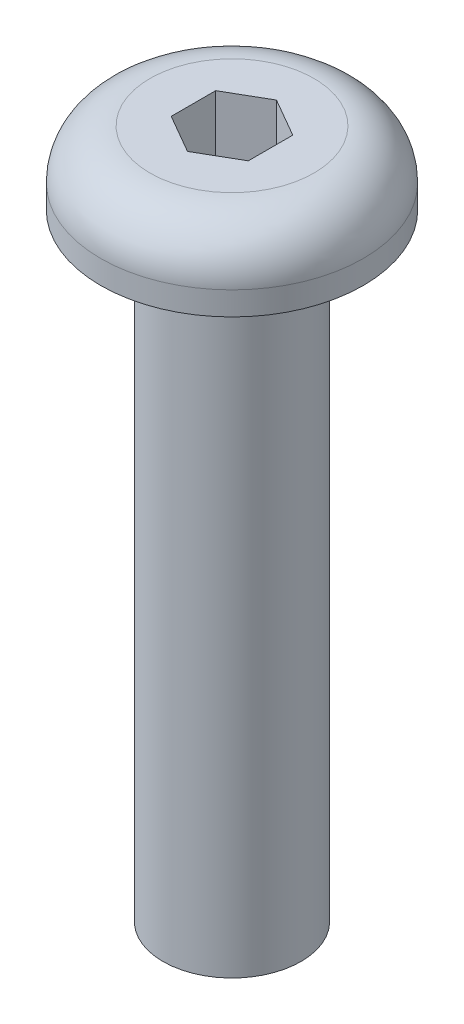
ISO-10303-21;
HEADER;
FILE_DESCRIPTION(('STEP AP214'),'2;1');
FILE_NAME('part.step','',(''),(''),'','','');
FILE_SCHEMA(('AUTOMOTIVE_DESIGN { 1 0 10303 214 1 1 1 1 }'));
ENDSEC;
DATA;
#1=APPLICATION_CONTEXT('core data for automotive mechanical design processes');
#2=APPLICATION_PROTOCOL_DEFINITION('international standard','automotive_design',2000,#1);
#3=PRODUCT_CONTEXT('',#1,'mechanical');
#4=PRODUCT('Part','Part','',(#3));
#5=PRODUCT_RELATED_PRODUCT_CATEGORY('part','',(#4));
#6=PRODUCT_DEFINITION_FORMATION('','',#4);
#7=PRODUCT_DEFINITION_CONTEXT('part definition',#1,'design');
#8=PRODUCT_DEFINITION('design','',#6,#7);
#9=PRODUCT_DEFINITION_SHAPE('','',#8);
#10=(LENGTH_UNIT() NAMED_UNIT(*) SI_UNIT(.MILLI.,.METRE.));
#11=(NAMED_UNIT(*) PLANE_ANGLE_UNIT() SI_UNIT($,.RADIAN.));
#12=(NAMED_UNIT(*) SI_UNIT($,.STERADIAN.) SOLID_ANGLE_UNIT());
#13=UNCERTAINTY_MEASURE_WITH_UNIT(LENGTH_MEASURE(1.E-05),#10,'distance_accuracy_value','');
#14=(GEOMETRIC_REPRESENTATION_CONTEXT(3) GLOBAL_UNCERTAINTY_ASSIGNED_CONTEXT((#13)) GLOBAL_UNIT_ASSIGNED_CONTEXT((#10,
#11,#12)) REPRESENTATION_CONTEXT('',''));
#15=CARTESIAN_POINT('',(0.,0.,0.));
#16=DIRECTION('',(0.,0.,1.));
#17=DIRECTION('',(1.,0.,0.));
#18=AXIS2_PLACEMENT_3D('',#15,#16,#17);
#19=CARTESIAN_POINT('',(0.,12.7,0.));
#20=DIRECTION('',(0.,-1.,0.));
#21=DIRECTION('',(0.,0.,-1.));
#22=AXIS2_PLACEMENT_3D('',#19,#20,#21);
#23=CYLINDRICAL_SURFACE('',#22,1.4224);
#24=CARTESIAN_POINT('',(0.,12.7,0.));
#25=DIRECTION('',(0.,1.,0.));
#26=DIRECTION('',(0.,0.,1.));
#27=AXIS2_PLACEMENT_3D('',#24,#25,#26);
#28=CIRCLE('',#27,1.4224);
#29=CARTESIAN_POINT('',(0.,12.7,1.4224));
#30=VERTEX_POINT('',#29);
#31=EDGE_CURVE('E143',#30,#30,#28,.T.);
#32=ORIENTED_EDGE('',*,*,#31,.F.);
#33=EDGE_LOOP('',(#32));
#34=FACE_BOUND('',#33,.T.);
#35=CARTESIAN_POINT('',(0.,0.,0.));
#36=DIRECTION('',(0.,1.,0.));
#37=DIRECTION('',(0.,0.,1.));
#38=AXIS2_PLACEMENT_3D('',#35,#36,#37);
#39=CIRCLE('',#38,1.4224);
#40=CARTESIAN_POINT('',(0.,0.,1.4224));
#41=VERTEX_POINT('',#40);
#42=EDGE_CURVE('E142',#41,#41,#39,.T.);
#43=ORIENTED_EDGE('',*,*,#42,.T.);
#44=EDGE_LOOP('',(#43));
#45=FACE_BOUND('',#44,.T.);
#46=ADVANCED_FACE('F32',(#34,#45),#23,.T.);
#47=CARTESIAN_POINT('',(0.,0.,0.));
#48=DIRECTION('',(0.,1.,0.));
#49=DIRECTION('',(0.,0.,1.));
#50=AXIS2_PLACEMENT_3D('',#47,#48,#49);
#51=PLANE('',#50);
#52=ORIENTED_EDGE('',*,*,#42,.F.);
#53=EDGE_LOOP('',(#52));
#54=FACE_BOUND('',#53,.T.);
#55=ADVANCED_FACE('F166',(#54),#51,.F.);
#56=CARTESIAN_POINT('',(0.,12.7,0.));
#57=DIRECTION('',(0.,1.,0.));
#58=DIRECTION('',(0.,0.,1.));
#59=AXIS2_PLACEMENT_3D('',#56,#57,#58);
#60=PLANE('',#59);
#61=CARTESIAN_POINT('',(0.,12.7,0.));
#62=DIRECTION('',(0.,1.,0.));
#63=DIRECTION('',(0.,0.,1.));
#64=AXIS2_PLACEMENT_3D('',#61,#62,#63);
#65=CIRCLE('',#64,2.7051);
#66=CARTESIAN_POINT('',(0.,12.7,2.7051));
#67=VERTEX_POINT('',#66);
#68=EDGE_CURVE('E134',#67,#67,#65,.T.);
#69=ORIENTED_EDGE('',*,*,#68,.F.);
#70=EDGE_LOOP('',(#69));
#71=FACE_BOUND('',#70,.T.);
#72=ORIENTED_EDGE('',*,*,#31,.T.);
#73=EDGE_LOOP('',(#72));
#74=FACE_BOUND('',#73,.T.);
#75=ADVANCED_FACE('F171',(#71,#74),#60,.F.);
#76=CARTESIAN_POINT('',(0.,14.1986,0.));
#77=DIRECTION('',(0.,-1.,0.));
#78=DIRECTION('',(0.,0.,-1.));
#79=AXIS2_PLACEMENT_3D('',#76,#77,#78);
#80=CYLINDRICAL_SURFACE('',#79,2.7051);
#81=CARTESIAN_POINT('',(0.,13.1826,0.));
#82=DIRECTION('',(0.,1.,0.));
#83=DIRECTION('',(0.,0.,1.));
#84=AXIS2_PLACEMENT_3D('',#81,#82,#83);
#85=CIRCLE('',#84,2.7051);
#86=CARTESIAN_POINT('',(0.,13.1826,2.7051));
#87=VERTEX_POINT('',#86);
#88=EDGE_CURVE('E11',#87,#87,#85,.F.);
#89=ORIENTED_EDGE('',*,*,#88,.T.);
#90=EDGE_LOOP('',(#89));
#91=FACE_BOUND('',#90,.T.);
#92=ORIENTED_EDGE('',*,*,#68,.T.);
#93=EDGE_LOOP('',(#92));
#94=FACE_BOUND('',#93,.T.);
#95=ADVANCED_FACE('F161',(#91,#94),#80,.T.);
#96=CARTESIAN_POINT('',(0.,14.1986,0.));
#97=DIRECTION('',(0.,1.,0.));
#98=DIRECTION('',(0.,0.,1.));
#99=AXIS2_PLACEMENT_3D('',#96,#97,#98);
#100=PLANE('',#99);
#101=DIRECTION('',(-0.866025403784438,0.,-0.5));
#102=VECTOR('',#101,1.);
#103=CARTESIAN_POINT('',(0.79375,14.1986,-0.458271776169266));
#104=LINE('',#103,#102);
#105=CARTESIAN_POINT('',(0.79375,14.1986,-0.458271776169266));
#106=VERTEX_POINT('',#105);
#107=CARTESIAN_POINT('',(0.,14.1986,-0.916543552338531));
#108=VERTEX_POINT('',#107);
#109=EDGE_CURVE('E47',#106,#108,#104,.T.);
#110=ORIENTED_EDGE('',*,*,#109,.F.);
#111=DIRECTION('',(0.,0.,-1.));
#112=VECTOR('',#111,1.);
#113=CARTESIAN_POINT('',(0.79375,14.1986,0.458271776169266));
#114=LINE('',#113,#112);
#115=CARTESIAN_POINT('',(0.79375,14.1986,0.458271776169266));
#116=VERTEX_POINT('',#115);
#117=EDGE_CURVE('E130',#116,#106,#114,.T.);
#118=ORIENTED_EDGE('',*,*,#117,.F.);
#119=DIRECTION('',(0.866025403784439,0.,-0.5));
#120=VECTOR('',#119,1.);
#121=CARTESIAN_POINT('',(0.,14.1986,0.916543552338531));
#122=LINE('',#121,#120);
#123=CARTESIAN_POINT('',(0.,14.1986,0.916543552338531));
#124=VERTEX_POINT('',#123);
#125=EDGE_CURVE('E128',#124,#116,#122,.T.);
#126=ORIENTED_EDGE('',*,*,#125,.F.);
#127=DIRECTION('',(0.866025403784439,0.,0.5));
#128=VECTOR('',#127,1.);
#129=CARTESIAN_POINT('',(-0.79375,14.1986,0.458271776169265));
#130=LINE('',#129,#128);
#131=CARTESIAN_POINT('',(-0.79375,14.1986,0.458271776169265));
#132=VERTEX_POINT('',#131);
#133=EDGE_CURVE('E95',#132,#124,#130,.T.);
#134=ORIENTED_EDGE('',*,*,#133,.F.);
#135=DIRECTION('',(0.,0.,1.));
#136=VECTOR('',#135,1.);
#137=CARTESIAN_POINT('',(-0.79375,14.1986,-0.458271776169265));
#138=LINE('',#137,#136);
#139=CARTESIAN_POINT('',(-0.79375,14.1986,-0.458271776169265));
#140=VERTEX_POINT('',#139);
#141=EDGE_CURVE('E124',#140,#132,#138,.T.);
#142=ORIENTED_EDGE('',*,*,#141,.F.);
#143=DIRECTION('',(-0.866025403784438,0.,0.5));
#144=VECTOR('',#143,1.);
#145=CARTESIAN_POINT('',(0.,14.1986,-0.916543552338531));
#146=LINE('',#145,#144);
#147=EDGE_CURVE('E121',#108,#140,#146,.T.);
#148=ORIENTED_EDGE('',*,*,#147,.F.);
#149=EDGE_LOOP('',(#110,#118,#126,#134,#142,#148));
#150=FACE_BOUND('',#149,.T.);
#151=CARTESIAN_POINT('',(0.,14.1986,0.));
#152=DIRECTION('',(0.,1.,0.));
#153=DIRECTION('',(0.,0.,1.));
#154=AXIS2_PLACEMENT_3D('',#151,#152,#153);
#155=CIRCLE('',#154,1.6891);
#156=CARTESIAN_POINT('',(0.,14.1986,1.6891));
#157=VERTEX_POINT('',#156);
#158=EDGE_CURVE('E40',#157,#157,#155,.T.);
#159=ORIENTED_EDGE('',*,*,#158,.T.);
#160=EDGE_LOOP('',(#159));
#161=FACE_BOUND('',#160,.T.);
#162=ADVANCED_FACE('F150',(#150,#161),#100,.T.);
#163=CARTESIAN_POINT('',(0.,13.1826,0.));
#164=DIRECTION('',(0.,1.,0.));
#165=DIRECTION('',(0.,0.,1.));
#166=AXIS2_PLACEMENT_3D('',#163,#164,#165);
#167=TOROIDAL_SURFACE('',#166,1.6891,1.016);
#168=ORIENTED_EDGE('',*,*,#88,.F.);
#169=EDGE_LOOP('',(#168));
#170=FACE_BOUND('',#169,.T.);
#171=ORIENTED_EDGE('',*,*,#158,.F.);
#172=EDGE_LOOP('',(#171));
#173=FACE_BOUND('',#172,.T.);
#174=ADVANCED_FACE('F34',(#170,#173),#167,.T.);
#175=CARTESIAN_POINT('',(0.79375,11.81735,-0.458271776169266));
#176=DIRECTION('',(0.5,0.,-0.866025403784439));
#177=DIRECTION('',(-0.866025403784438,0.,-0.5));
#178=AXIS2_PLACEMENT_3D('',#175,#176,#177);
#179=PLANE('',#178);
#180=ORIENTED_EDGE('',*,*,#109,.T.);
#181=DIRECTION('',(0.,1.,0.));
#182=VECTOR('',#181,1.);
#183=CARTESIAN_POINT('',(0.,11.81735,-0.916543552338531));
#184=LINE('',#183,#182);
#185=CARTESIAN_POINT('',(0.,11.81735,-0.916543552338531));
#186=VERTEX_POINT('',#185);
#187=EDGE_CURVE('E77',#186,#108,#184,.T.);
#188=ORIENTED_EDGE('',*,*,#187,.F.);
#189=DIRECTION('',(-0.866025403784438,0.,-0.5));
#190=VECTOR('',#189,1.);
#191=CARTESIAN_POINT('',(0.79375,11.81735,-0.458271776169266));
#192=LINE('',#191,#190);
#193=CARTESIAN_POINT('',(0.79375,11.81735,-0.458271776169266));
#194=VERTEX_POINT('',#193);
#195=EDGE_CURVE('E132',#194,#186,#192,.T.);
#196=ORIENTED_EDGE('',*,*,#195,.F.);
#197=DIRECTION('',(0.,1.,0.));
#198=VECTOR('',#197,1.);
#199=CARTESIAN_POINT('',(0.79375,11.81735,-0.458271776169266));
#200=LINE('',#199,#198);
#201=EDGE_CURVE('E55',#194,#106,#200,.T.);
#202=ORIENTED_EDGE('',*,*,#201,.T.);
#203=EDGE_LOOP('',(#180,#188,#196,#202));
#204=FACE_BOUND('',#203,.T.);
#205=ADVANCED_FACE('F153',(#204),#179,.F.);
#206=CARTESIAN_POINT('',(0.79375,11.81735,0.458271776169266));
#207=DIRECTION('',(1.,0.,0.));
#208=DIRECTION('',(0.,0.,-1.));
#209=AXIS2_PLACEMENT_3D('',#206,#207,#208);
#210=PLANE('',#209);
#211=ORIENTED_EDGE('',*,*,#117,.T.);
#212=ORIENTED_EDGE('',*,*,#201,.F.);
#213=DIRECTION('',(0.,0.,-1.));
#214=VECTOR('',#213,1.);
#215=CARTESIAN_POINT('',(0.79375,11.81735,0.458271776169266));
#216=LINE('',#215,#214);
#217=CARTESIAN_POINT('',(0.79375,11.81735,0.458271776169266));
#218=VERTEX_POINT('',#217);
#219=EDGE_CURVE('E107',#218,#194,#216,.T.);
#220=ORIENTED_EDGE('',*,*,#219,.F.);
#221=DIRECTION('',(0.,1.,0.));
#222=VECTOR('',#221,1.);
#223=CARTESIAN_POINT('',(0.79375,11.81735,0.458271776169266));
#224=LINE('',#223,#222);
#225=EDGE_CURVE('E99',#218,#116,#224,.T.);
#226=ORIENTED_EDGE('',*,*,#225,.T.);
#227=EDGE_LOOP('',(#211,#212,#220,#226));
#228=FACE_BOUND('',#227,.T.);
#229=ADVANCED_FACE('F159',(#228),#210,.F.);
#230=CARTESIAN_POINT('',(0.,11.81735,0.916543552338531));
#231=DIRECTION('',(0.5,0.,0.866025403784439));
#232=DIRECTION('',(0.866025403784439,0.,-0.5));
#233=AXIS2_PLACEMENT_3D('',#230,#231,#232);
#234=PLANE('',#233);
#235=ORIENTED_EDGE('',*,*,#125,.T.);
#236=ORIENTED_EDGE('',*,*,#225,.F.);
#237=DIRECTION('',(0.866025403784439,0.,-0.5));
#238=VECTOR('',#237,1.);
#239=CARTESIAN_POINT('',(0.,11.81735,0.916543552338531));
#240=LINE('',#239,#238);
#241=CARTESIAN_POINT('',(0.,11.81735,0.916543552338531));
#242=VERTEX_POINT('',#241);
#243=EDGE_CURVE('E103',#242,#218,#240,.T.);
#244=ORIENTED_EDGE('',*,*,#243,.F.);
#245=DIRECTION('',(0.,1.,0.));
#246=VECTOR('',#245,1.);
#247=CARTESIAN_POINT('',(0.,11.81735,0.916543552338531));
#248=LINE('',#247,#246);
#249=EDGE_CURVE('E88',#242,#124,#248,.T.);
#250=ORIENTED_EDGE('',*,*,#249,.T.);
#251=EDGE_LOOP('',(#235,#236,#244,#250));
#252=FACE_BOUND('',#251,.T.);
#253=ADVANCED_FACE('F104',(#252),#234,.F.);
#254=CARTESIAN_POINT('',(-0.79375,11.81735,0.458271776169265));
#255=DIRECTION('',(-0.5,0.,0.866025403784439));
#256=DIRECTION('',(0.866025403784438,0.,0.5));
#257=AXIS2_PLACEMENT_3D('',#254,#255,#256);
#258=PLANE('',#257);
#259=ORIENTED_EDGE('',*,*,#133,.T.);
#260=ORIENTED_EDGE('',*,*,#249,.F.);
#261=DIRECTION('',(0.866025403784439,0.,0.5));
#262=VECTOR('',#261,1.);
#263=CARTESIAN_POINT('',(-0.79375,11.81735,0.458271776169265));
#264=LINE('',#263,#262);
#265=CARTESIAN_POINT('',(-0.79375,11.81735,0.458271776169265));
#266=VERTEX_POINT('',#265);
#267=EDGE_CURVE('E92',#266,#242,#264,.T.);
#268=ORIENTED_EDGE('',*,*,#267,.F.);
#269=DIRECTION('',(0.,1.,0.));
#270=VECTOR('',#269,1.);
#271=CARTESIAN_POINT('',(-0.79375,11.81735,0.458271776169265));
#272=LINE('',#271,#270);
#273=EDGE_CURVE('E100',#266,#132,#272,.T.);
#274=ORIENTED_EDGE('',*,*,#273,.T.);
#275=EDGE_LOOP('',(#259,#260,#268,#274));
#276=FACE_BOUND('',#275,.T.);
#277=ADVANCED_FACE('F90',(#276),#258,.F.);
#278=CARTESIAN_POINT('',(-0.79375,11.81735,-0.458271776169265));
#279=DIRECTION('',(-1.,0.,0.));
#280=DIRECTION('',(0.,0.,1.));
#281=AXIS2_PLACEMENT_3D('',#278,#279,#280);
#282=PLANE('',#281);
#283=ORIENTED_EDGE('',*,*,#141,.T.);
#284=ORIENTED_EDGE('',*,*,#273,.F.);
#285=DIRECTION('',(0.,0.,1.));
#286=VECTOR('',#285,1.);
#287=CARTESIAN_POINT('',(-0.79375,11.81735,-0.458271776169265));
#288=LINE('',#287,#286);
#289=CARTESIAN_POINT('',(-0.79375,11.81735,-0.458271776169265));
#290=VERTEX_POINT('',#289);
#291=EDGE_CURVE('E113',#290,#266,#288,.T.);
#292=ORIENTED_EDGE('',*,*,#291,.F.);
#293=DIRECTION('',(0.,1.,0.));
#294=VECTOR('',#293,1.);
#295=CARTESIAN_POINT('',(-0.79375,11.81735,-0.458271776169265));
#296=LINE('',#295,#294);
#297=EDGE_CURVE('E137',#290,#140,#296,.T.);
#298=ORIENTED_EDGE('',*,*,#297,.T.);
#299=EDGE_LOOP('',(#283,#284,#292,#298));
#300=FACE_BOUND('',#299,.T.);
#301=ADVANCED_FACE('F186',(#300),#282,.F.);
#302=CARTESIAN_POINT('',(0.,11.81735,-0.916543552338531));
#303=DIRECTION('',(-0.5,0.,-0.866025403784439));
#304=DIRECTION('',(-0.866025403784438,0.,0.5));
#305=AXIS2_PLACEMENT_3D('',#302,#303,#304);
#306=PLANE('',#305);
#307=ORIENTED_EDGE('',*,*,#147,.T.);
#308=ORIENTED_EDGE('',*,*,#297,.F.);
#309=DIRECTION('',(-0.866025403784438,0.,0.5));
#310=VECTOR('',#309,1.);
#311=CARTESIAN_POINT('',(0.,11.81735,-0.916543552338531));
#312=LINE('',#311,#310);
#313=EDGE_CURVE('E115',#186,#290,#312,.T.);
#314=ORIENTED_EDGE('',*,*,#313,.F.);
#315=ORIENTED_EDGE('',*,*,#187,.T.);
#316=EDGE_LOOP('',(#307,#308,#314,#315));
#317=FACE_BOUND('',#316,.T.);
#318=ADVANCED_FACE('F183',(#317),#306,.F.);
#319=CARTESIAN_POINT('',(0.,11.81735,-0.916543552338531));
#320=DIRECTION('',(0.,1.,0.));
#321=DIRECTION('',(0.,0.,1.));
#322=AXIS2_PLACEMENT_3D('',#319,#320,#321);
#323=PLANE('',#322);
#324=ORIENTED_EDGE('',*,*,#195,.T.);
#325=ORIENTED_EDGE('',*,*,#313,.T.);
#326=ORIENTED_EDGE('',*,*,#291,.T.);
#327=ORIENTED_EDGE('',*,*,#267,.T.);
#328=ORIENTED_EDGE('',*,*,#243,.T.);
#329=ORIENTED_EDGE('',*,*,#219,.T.);
#330=EDGE_LOOP('',(#324,#325,#326,#327,#328,#329));
#331=FACE_BOUND('',#330,.T.);
#332=ADVANCED_FACE('F110',(#331),#323,.T.);
#333=CLOSED_SHELL('',(#46,#55,#75,#95,#162,#174,#205,#229,#253,#277,#301,#318,#332));
#334=MANIFOLD_SOLID_BREP('B2',#333);
#335=ADVANCED_BREP_SHAPE_REPRESENTATION('',(#18,#334),#14);
#336=SHAPE_DEFINITION_REPRESENTATION(#9,#335);
ENDSEC;
END-ISO-10303-21;
